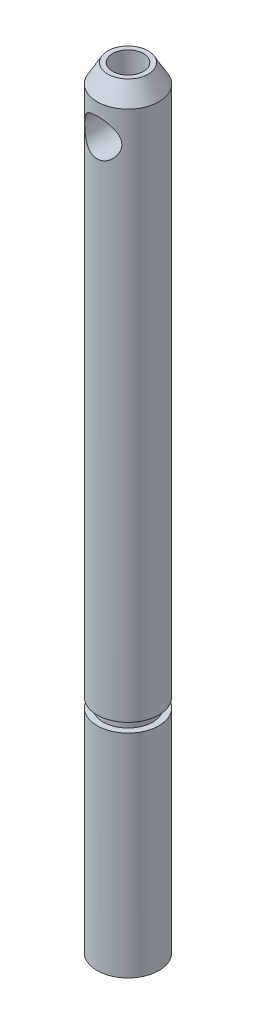
ISO-10303-21;
HEADER;
FILE_DESCRIPTION(('STEP AP214'),'2;1');
FILE_NAME('part.step','',(''),(''),'','','');
FILE_SCHEMA(('AUTOMOTIVE_DESIGN { 1 0 10303 214 1 1 1 1 }'));
ENDSEC;
DATA;
#1=APPLICATION_CONTEXT('core data for automotive mechanical design processes');
#2=APPLICATION_PROTOCOL_DEFINITION('international standard','automotive_design',2000,#1);
#3=PRODUCT_CONTEXT('',#1,'mechanical');
#4=PRODUCT('Part','Part','',(#3));
#5=PRODUCT_RELATED_PRODUCT_CATEGORY('part','',(#4));
#6=PRODUCT_DEFINITION_FORMATION('','',#4);
#7=PRODUCT_DEFINITION_CONTEXT('part definition',#1,'design');
#8=PRODUCT_DEFINITION('design','',#6,#7);
#9=PRODUCT_DEFINITION_SHAPE('','',#8);
#10=(LENGTH_UNIT() NAMED_UNIT(*) SI_UNIT(.MILLI.,.METRE.));
#11=(NAMED_UNIT(*) PLANE_ANGLE_UNIT() SI_UNIT($,.RADIAN.));
#12=(NAMED_UNIT(*) SI_UNIT($,.STERADIAN.) SOLID_ANGLE_UNIT());
#13=UNCERTAINTY_MEASURE_WITH_UNIT(LENGTH_MEASURE(1.E-05),#10,'distance_accuracy_value','');
#14=(GEOMETRIC_REPRESENTATION_CONTEXT(3) GLOBAL_UNCERTAINTY_ASSIGNED_CONTEXT((#13)) GLOBAL_UNIT_ASSIGNED_CONTEXT((#10,
#11,#12)) REPRESENTATION_CONTEXT('',''));
#15=CARTESIAN_POINT('',(0.,0.,0.));
#16=DIRECTION('',(0.,0.,1.));
#17=DIRECTION('',(1.,0.,0.));
#18=AXIS2_PLACEMENT_3D('',#15,#16,#17);
#19=CARTESIAN_POINT('',(-2.5,6.,-2.5));
#20=DIRECTION('',(0.,1.,0.));
#21=DIRECTION('',(0.,0.,1.));
#22=AXIS2_PLACEMENT_3D('',#19,#20,#21);
#23=PLANE('',#22);
#24=CARTESIAN_POINT('',(0.,6.,0.));
#25=DIRECTION('',(0.,-1.,0.));
#26=DIRECTION('',(0.,0.,-1.));
#27=AXIS2_PLACEMENT_3D('',#24,#25,#26);
#28=CIRCLE('',#27,2.5);
#29=CARTESIAN_POINT('',(-1.5,6.,-2.));
#30=VERTEX_POINT('',#29);
#31=CARTESIAN_POINT('',(-1.5,6.,2.));
#32=VERTEX_POINT('',#31);
#33=EDGE_CURVE('E20',#30,#32,#28,.F.);
#34=ORIENTED_EDGE('',*,*,#33,.F.);
#35=DIRECTION('',(0.,0.,-1.));
#36=VECTOR('',#35,1.);
#37=CARTESIAN_POINT('',(-1.5,6.,-2.5));
#38=LINE('',#37,#36);
#39=EDGE_CURVE('E43',#30,#32,#38,.F.);
#40=ORIENTED_EDGE('',*,*,#39,.T.);
#41=EDGE_LOOP('',(#34,#40));
#42=FACE_BOUND('',#41,.T.);
#43=ADVANCED_FACE('F17',(#42),#23,.F.);
#44=CARTESIAN_POINT('',(-1.5,0.,-2.5));
#45=DIRECTION('',(1.,0.,0.));
#46=DIRECTION('',(0.,0.,-1.));
#47=AXIS2_PLACEMENT_3D('',#44,#45,#46);
#48=PLANE('',#47);
#49=DIRECTION('',(0.,-1.,0.));
#50=VECTOR('',#49,1.);
#51=CARTESIAN_POINT('',(-1.5,62.34264779,-2.));
#52=LINE('',#51,#50);
#53=CARTESIAN_POINT('',(-1.5,0.,-2.));
#54=VERTEX_POINT('',#53);
#55=EDGE_CURVE('E51',#54,#30,#52,.F.);
#56=ORIENTED_EDGE('',*,*,#55,.F.);
#57=DIRECTION('',(0.,0.,1.));
#58=VECTOR('',#57,1.);
#59=CARTESIAN_POINT('',(-1.5,0.,0.));
#60=LINE('',#59,#58);
#61=CARTESIAN_POINT('',(-1.5,0.,2.));
#62=VERTEX_POINT('',#61);
#63=EDGE_CURVE('E54',#54,#62,#60,.T.);
#64=ORIENTED_EDGE('',*,*,#63,.T.);
#65=DIRECTION('',(0.,-1.,0.));
#66=VECTOR('',#65,1.);
#67=CARTESIAN_POINT('',(-1.5,62.34264779,2.));
#68=LINE('',#67,#66);
#69=EDGE_CURVE('E52',#32,#62,#68,.T.);
#70=ORIENTED_EDGE('',*,*,#69,.F.);
#71=ORIENTED_EDGE('',*,*,#39,.F.);
#72=EDGE_LOOP('',(#56,#64,#70,#71));
#73=FACE_BOUND('',#72,.T.);
#74=ADVANCED_FACE('F57',(#73),#48,.F.);
#75=CARTESIAN_POINT('',(0.,0.,0.));
#76=DIRECTION('',(0.,1.,0.));
#77=DIRECTION('',(0.,0.,1.));
#78=AXIS2_PLACEMENT_3D('',#75,#76,#77);
#79=PLANE('',#78);
#80=ORIENTED_EDGE('',*,*,#63,.F.);
#81=CARTESIAN_POINT('',(0.,0.,0.));
#82=DIRECTION('',(0.,-1.,0.));
#83=DIRECTION('',(0.,0.,-1.));
#84=AXIS2_PLACEMENT_3D('',#81,#82,#83);
#85=CIRCLE('',#84,2.5);
#86=EDGE_CURVE('E34',#62,#54,#85,.F.);
#87=ORIENTED_EDGE('',*,*,#86,.F.);
#88=EDGE_LOOP('',(#80,#87));
#89=FACE_BOUND('',#88,.T.);
#90=ADVANCED_FACE('F55',(#89),#79,.F.);
#91=CARTESIAN_POINT('',(0.,62.34264779,0.));
#92=DIRECTION('',(0.,-1.,0.));
#93=DIRECTION('',(0.,0.,-1.));
#94=AXIS2_PLACEMENT_3D('',#91,#92,#93);
#95=CYLINDRICAL_SURFACE('',#94,2.5);
#96=ORIENTED_EDGE('',*,*,#69,.T.);
#97=ORIENTED_EDGE('',*,*,#86,.T.);
#98=ORIENTED_EDGE('',*,*,#55,.T.);
#99=ORIENTED_EDGE('',*,*,#33,.T.);
#100=EDGE_LOOP('',(#96,#97,#98,#99));
#101=FACE_BOUND('',#100,.T.);
#102=CARTESIAN_POINT('',(0.,17.15,0.));
#103=DIRECTION('',(0.,-1.,0.));
#104=DIRECTION('',(0.,0.,-1.));
#105=AXIS2_PLACEMENT_3D('',#102,#103,#104);
#106=CIRCLE('',#105,2.5);
#107=CARTESIAN_POINT('',(0.,17.15,-2.5));
#108=VERTEX_POINT('',#107);
#109=EDGE_CURVE('E53',#108,#108,#106,.F.);
#110=ORIENTED_EDGE('',*,*,#109,.F.);
#111=EDGE_LOOP('',(#110));
#112=FACE_BOUND('',#111,.T.);
#113=ADVANCED_FACE('F48',(#101,#112),#95,.T.);
#114=CARTESIAN_POINT('',(0.,17.15,0.));
#115=DIRECTION('',(0.,1.,0.));
#116=DIRECTION('',(0.,0.,1.));
#117=AXIS2_PLACEMENT_3D('',#114,#115,#116);
#118=PLANE('',#117);
#119=ORIENTED_EDGE('',*,*,#109,.T.);
#120=EDGE_LOOP('',(#119));
#121=FACE_BOUND('',#120,.T.);
#122=CARTESIAN_POINT('',(0.,17.15,0.));
#123=DIRECTION('',(0.,-1.,0.));
#124=DIRECTION('',(0.,0.,-1.));
#125=AXIS2_PLACEMENT_3D('',#122,#123,#124);
#126=CIRCLE('',#125,2.);
#127=CARTESIAN_POINT('',(0.,17.15,-2.));
#128=VERTEX_POINT('',#127);
#129=EDGE_CURVE('E133',#128,#128,#126,.F.);
#130=ORIENTED_EDGE('',*,*,#129,.F.);
#131=EDGE_LOOP('',(#130));
#132=FACE_BOUND('',#131,.T.);
#133=ADVANCED_FACE('F103',(#121,#132),#118,.T.);
#134=CARTESIAN_POINT('',(0.,62.34264779,0.));
#135=DIRECTION('',(0.,1.,0.));
#136=DIRECTION('',(0.,0.,1.));
#137=AXIS2_PLACEMENT_3D('',#134,#135,#136);
#138=PLANE('',#137);
#139=CARTESIAN_POINT('',(0.,62.3426477899329,0.));
#140=DIRECTION('',(0.,-1.,0.));
#141=DIRECTION('',(0.,0.,-1.));
#142=AXIS2_PLACEMENT_3D('',#139,#140,#141);
#143=CIRCLE('',#142,1.63397459617341);
#144=CARTESIAN_POINT('',(0.,62.3426477899329,-1.63397459617341));
#145=VERTEX_POINT('',#144);
#146=EDGE_CURVE('E129',#145,#145,#143,.T.);
#147=ORIENTED_EDGE('',*,*,#146,.F.);
#148=EDGE_LOOP('',(#147));
#149=FACE_BOUND('',#148,.T.);
#150=CARTESIAN_POINT('',(0.,62.34264779,0.));
#151=DIRECTION('',(0.,1.,0.));
#152=DIRECTION('',(0.,0.,1.));
#153=AXIS2_PLACEMENT_3D('',#150,#151,#152);
#154=CIRCLE('',#153,1.24999999999999);
#155=CARTESIAN_POINT('',(0.,62.34264779,1.24999999999999));
#156=VERTEX_POINT('',#155);
#157=EDGE_CURVE('E130',#156,#156,#154,.F.);
#158=ORIENTED_EDGE('',*,*,#157,.T.);
#159=EDGE_LOOP('',(#158));
#160=FACE_BOUND('',#159,.T.);
#161=ADVANCED_FACE('F99',(#149,#160),#138,.T.);
#162=CARTESIAN_POINT('',(0.,17.9,0.));
#163=DIRECTION('',(0.,-1.,0.));
#164=DIRECTION('',(0.,0.,-1.));
#165=AXIS2_PLACEMENT_3D('',#162,#163,#164);
#166=CYLINDRICAL_SURFACE('',#165,2.);
#167=CARTESIAN_POINT('',(0.,17.9,0.));
#168=DIRECTION('',(0.,-1.,0.));
#169=DIRECTION('',(0.,0.,-1.));
#170=AXIS2_PLACEMENT_3D('',#167,#168,#169);
#171=CIRCLE('',#170,2.);
#172=CARTESIAN_POINT('',(0.,17.9,-2.));
#173=VERTEX_POINT('',#172);
#174=EDGE_CURVE('E87',#173,#173,#171,.T.);
#175=ORIENTED_EDGE('',*,*,#174,.T.);
#176=EDGE_LOOP('',(#175));
#177=FACE_BOUND('',#176,.T.);
#178=ORIENTED_EDGE('',*,*,#129,.T.);
#179=EDGE_LOOP('',(#178));
#180=FACE_BOUND('',#179,.T.);
#181=ADVANCED_FACE('F95',(#177,#180),#166,.T.);
#182=CARTESIAN_POINT('',(0.,62.34264779,0.));
#183=DIRECTION('',(0.,1.,0.));
#184=DIRECTION('',(0.,0.,1.));
#185=AXIS2_PLACEMENT_3D('',#182,#183,#184);
#186=CYLINDRICAL_SURFACE('',#185,1.24999999999999);
#187=ORIENTED_EDGE('',*,*,#157,.F.);
#188=EDGE_LOOP('',(#187));
#189=FACE_BOUND('',#188,.T.);
#190=CARTESIAN_POINT('',(0.,59.84264779,1.24999999999999));
#191=CARTESIAN_POINT('',(-0.0593862108893855,59.8426462254231,1.24999840223836));
#192=CARTESIAN_POINT('',(-0.118783629228726,59.8390909261592,1.24573846293185));
#193=CARTESIAN_POINT('',(-0.235596832688722,59.825200205701,1.22901697889288));
#194=CARTESIAN_POINT('',(-0.293011355967574,59.8148605479273,1.21655030934694));
#195=CARTESIAN_POINT('',(-0.4039148520295,59.7883613388128,1.18434409367316));
#196=CARTESIAN_POINT('',(-0.457424881903688,59.7722362926995,1.16464765163541));
#197=CARTESIAN_POINT('',(-0.559919566606722,59.7352942664348,1.11899204778939));
#198=CARTESIAN_POINT('',(-0.608902608913669,59.7144756234275,1.09303066619723));
#199=CARTESIAN_POINT('',(-0.718951238642796,59.6610174010017,1.02527233436066));
#200=CARTESIAN_POINT('',(-0.77784639940029,59.6268446313228,0.981161421871724));
#201=CARTESIAN_POINT('',(-0.886006686488863,59.5547668282188,0.884741313262738));
#202=CARTESIAN_POINT('',(-0.935244207529233,59.5168515485879,0.832409364542025));
#203=CARTESIAN_POINT('',(-1.02476983798438,59.4396432509587,0.719475641159833));
#204=CARTESIAN_POINT('',(-1.06487544430448,59.4003377215115,0.658738733919066));
#205=CARTESIAN_POINT('',(-1.13460949608151,59.3251211355924,0.529649265340283));
#206=CARTESIAN_POINT('',(-1.16426871520539,59.2892003410764,0.461319866247311));
#207=CARTESIAN_POINT('',(-1.20096809439559,59.241614492326,0.349152320443061));
#208=CARTESIAN_POINT('',(-1.21216917782273,59.2263312426768,0.308234148450566));
#209=CARTESIAN_POINT('',(-1.23050643067161,59.2006117991523,0.224058905453696));
#210=CARTESIAN_POINT('',(-1.23765246664524,59.1901638517805,0.180807794373419));
#211=CARTESIAN_POINT('',(-1.24740539221829,59.175752933635,0.092116217355069));
#212=CARTESIAN_POINT('',(-1.24995600516591,59.1718703993564,0.0466555184271497));
#213=CARTESIAN_POINT('',(-1.25004286689023,59.1717392762581,-0.0442807059069726));
#214=CARTESIAN_POINT('',(-1.24757904453308,59.1754907957337,-0.0897562315143542));
#215=CARTESIAN_POINT('',(-1.23752619395373,59.1903556893603,-0.182763617342337));
#216=CARTESIAN_POINT('',(-1.22952742988471,59.2020561351512,-0.230151334824196));
#217=CARTESIAN_POINT('',(-1.20871315183512,59.2310903716655,-0.322101270368631));
#218=CARTESIAN_POINT('',(-1.19588166745774,59.2484428142111,-0.366653541301658));
#219=CARTESIAN_POINT('',(-1.15722563573576,59.2977869252654,-0.478104398962175));
#220=CARTESIAN_POINT('',(-1.12819926112772,59.3323823324722,-0.542714881249848));
#221=CARTESIAN_POINT('',(-1.0607172141723,59.4044114208193,-0.665028745762589));
#222=CARTESIAN_POINT('',(-1.0222446909771,59.4418500906604,-0.722719507187034));
#223=CARTESIAN_POINT('',(-0.933840379141559,59.5180312554999,-0.834118223949501));
#224=CARTESIAN_POINT('',(-0.883415624625791,59.5567399273556,-0.887461584333355));
#225=CARTESIAN_POINT('',(-0.772423842793293,59.6301942554712,-0.985556233166051));
#226=CARTESIAN_POINT('',(-0.711878443813805,59.6649481026967,-1.03032541634234));
#227=CARTESIAN_POINT('',(-0.597043972785364,59.7197980212542,-1.09971479649105));
#228=CARTESIAN_POINT('',(-0.544838910103937,59.741400897607,-1.1265855335296));
#229=CARTESIAN_POINT('',(-0.43550123495752,59.779195941306,-1.17318254741894));
#230=CARTESIAN_POINT('',(-0.37837443534328,59.7953943842958,-1.19291711306153));
#231=CARTESIAN_POINT('',(-0.268099249929752,59.8194289044178,-1.22206407173247));
#232=CARTESIAN_POINT('',(-0.215395620136184,59.8280769981845,-1.23248316066811));
#233=CARTESIAN_POINT('',(-0.108464202701556,59.839686488855,-1.24645104909721));
#234=CARTESIAN_POINT('',(-0.0542367754002226,59.8426492189109,-1.25000145921818));
#235=CARTESIAN_POINT('',(0.0593862108893855,59.8426462254231,-1.24999840223836));
#236=CARTESIAN_POINT('',(0.118783629228727,59.8390909261592,-1.24573846293185));
#237=CARTESIAN_POINT('',(0.235596832688722,59.825200205701,-1.22901697889288));
#238=CARTESIAN_POINT('',(0.293011355967574,59.8148605479273,-1.21655030934694));
#239=CARTESIAN_POINT('',(0.403914852029501,59.7883613388128,-1.18434409367316));
#240=CARTESIAN_POINT('',(0.457424881903689,59.7722362926995,-1.16464765163541));
#241=CARTESIAN_POINT('',(0.559919566606722,59.7352942664348,-1.11899204778939));
#242=CARTESIAN_POINT('',(0.60890260891367,59.7144756234275,-1.09303066619723));
#243=CARTESIAN_POINT('',(0.718951238642797,59.6610174010017,-1.02527233436066));
#244=CARTESIAN_POINT('',(0.777846399400291,59.6268446313228,-0.981161421871723));
#245=CARTESIAN_POINT('',(0.886006686488864,59.5547668282188,-0.884741313262737));
#246=CARTESIAN_POINT('',(0.935244207529234,59.5168515485879,-0.832409364542024));
#247=CARTESIAN_POINT('',(1.02476983798438,59.4396432509587,-0.719475641159832));
#248=CARTESIAN_POINT('',(1.06487544430448,59.4003377215115,-0.658738733919065));
#249=CARTESIAN_POINT('',(1.13460949608151,59.3251211355924,-0.529649265340281));
#250=CARTESIAN_POINT('',(1.16426871520539,59.2892003410764,-0.461319866247308));
#251=CARTESIAN_POINT('',(1.20096809439559,59.241614492326,-0.349152320443057));
#252=CARTESIAN_POINT('',(1.21216917782273,59.2263312426768,-0.308234148450561));
#253=CARTESIAN_POINT('',(1.23050643067161,59.2006117991522,-0.224058905453691));
#254=CARTESIAN_POINT('',(1.23765246664524,59.1901638517805,-0.180807794373413));
#255=CARTESIAN_POINT('',(1.24740539221829,59.175752933635,-0.0921162173550637));
#256=CARTESIAN_POINT('',(1.24995600516591,59.1718703993564,-0.0466555184271445));
#257=CARTESIAN_POINT('',(1.25004286689023,59.1717392762581,0.044280705906978));
#258=CARTESIAN_POINT('',(1.24757904453308,59.1754907957337,0.0897562315143598));
#259=CARTESIAN_POINT('',(1.23752619395373,59.1903556893603,0.182763617342343));
#260=CARTESIAN_POINT('',(1.22952742988471,59.2020561351512,0.230151334824203));
#261=CARTESIAN_POINT('',(1.20871315183512,59.2310903716655,0.322101270368639));
#262=CARTESIAN_POINT('',(1.19588166745774,59.2484428142111,0.366653541301667));
#263=CARTESIAN_POINT('',(1.15722563573575,59.2977869252654,0.478104398962184));
#264=CARTESIAN_POINT('',(1.12819926112772,59.3323823324722,0.542714881249858));
#265=CARTESIAN_POINT('',(1.06071721417229,59.4044114208193,0.665028745762601));
#266=CARTESIAN_POINT('',(1.02224469097709,59.4418500906604,0.722719507187049));
#267=CARTESIAN_POINT('',(0.933840379141546,59.5180312554999,0.834118223949516));
#268=CARTESIAN_POINT('',(0.883415624625778,59.5567399273557,0.887461584333368));
#269=CARTESIAN_POINT('',(0.772423842793279,59.6301942554712,0.985556233166062));
#270=CARTESIAN_POINT('',(0.711878443813788,59.6649481026967,1.03032541634236));
#271=CARTESIAN_POINT('',(0.597043972785347,59.7197980212542,1.09971479649106));
#272=CARTESIAN_POINT('',(0.544838910103921,59.741400897607,1.12658553352961));
#273=CARTESIAN_POINT('',(0.435501234957505,59.779195941306,1.17318254741894));
#274=CARTESIAN_POINT('',(0.378374435343263,59.7953943842958,1.19291711306154));
#275=CARTESIAN_POINT('',(0.268099249929737,59.8194289044178,1.22206407173247));
#276=CARTESIAN_POINT('',(0.215395620136172,59.8280769981845,1.23248316066811));
#277=CARTESIAN_POINT('',(0.10846420270155,59.839686488855,1.24645104909721));
#278=CARTESIAN_POINT('',(0.0542367754002195,59.8426492189109,1.25000145921818));
#279=CARTESIAN_POINT('',(0.,59.84264779,1.24999999999999));
#280=B_SPLINE_CURVE_WITH_KNOTS('',3,(#190,#191,#192,#193,#194,#195,#196,#197,#198,#199,#200,
#201,#202,#203,#204,#205,#206,#207,#208,#209,#210,#211,#212,#213,#214,#215,#216,#217,#218,#219,
#220,#221,#222,#223,#224,#225,#226,#227,#228,#229,#230,#231,#232,#233,#234,#235,#236,#237,#238,
#239,#240,#241,#242,#243,#244,#245,#246,#247,#248,#249,#250,#251,#252,#253,#254,#255,#256,#257,
#258,#259,#260,#261,#262,#263,#264,#265,#266,#267,#268,#269,#270,#271,#272,#273,#274,#275,#276,
#277,#278,#279),.UNSPECIFIED.,.T.,.F.,(4,2,2,2,2,2,2,2,2,2,2,2,2,2,2,2,2,2,2,2,2,2,2,2,2,2,2,2,
2,2,2,2,2,2,2,2,2,2,2,2,2,2,2,2,4),(0.,0.177930937889002,0.355973092906779,0.532970554628085,
0.710030822140077,0.952125903940765,1.19490321356839,1.44217387415895,1.68870989294429,
1.82361318456846,1.95818681265893,2.09439754075969,2.23061020113417,2.37816655612912,
2.52621487216841,2.76143399504807,2.99707581002108,3.24500621660523,3.49241340274582,
3.6793903649474,3.8661494470989,4.02868994068313,4.19119231573804,4.36912325362705,
4.54716540864482,4.72416287036613,4.90122313787812,5.14331821967881,5.38609552930643,
5.633366189897,5.87990220868233,6.01480550030651,6.14937912839697,6.28558985649774,
6.42180251687222,6.56935887186717,6.71740718790647,6.95262631078612,7.18826812575915,
7.4361985323433,7.68360571848388,7.87058268068546,8.05734176283696,8.21988225642119,
8.38238463147608),.UNSPECIFIED.);
#281=CARTESIAN_POINT('',(0.,59.84264779,1.24999999999999));
#282=VERTEX_POINT('',#281);
#283=EDGE_CURVE('E81',#282,#282,#280,.T.);
#284=ORIENTED_EDGE('',*,*,#283,.T.);
#285=EDGE_LOOP('',(#284));
#286=FACE_BOUND('',#285,.T.);
#287=ADVANCED_FACE('F89',(#189,#286),#186,.F.);
#288=CARTESIAN_POINT('',(0.,60.8426477901389,0.));
#289=DIRECTION('',(0.,-1.,0.));
#290=DIRECTION('',(0.,0.,-1.));
#291=AXIS2_PLACEMENT_3D('',#288,#289,#290);
#292=CONICAL_SURFACE('',#291,2.4999999998272,0.523598775592442);
#293=CARTESIAN_POINT('',(0.,60.84264779,0.));
#294=DIRECTION('',(0.,-1.,0.));
#295=DIRECTION('',(0.,0.,-1.));
#296=AXIS2_PLACEMENT_3D('',#293,#294,#295);
#297=CIRCLE('',#296,2.5);
#298=CARTESIAN_POINT('',(0.,60.84264779,-2.5));
#299=VERTEX_POINT('',#298);
#300=EDGE_CURVE('E80',#299,#299,#297,.T.);
#301=ORIENTED_EDGE('',*,*,#300,.F.);
#302=EDGE_LOOP('',(#301));
#303=FACE_BOUND('',#302,.T.);
#304=ORIENTED_EDGE('',*,*,#146,.T.);
#305=EDGE_LOOP('',(#304));
#306=FACE_BOUND('',#305,.T.);
#307=ADVANCED_FACE('F94',(#303,#306),#292,.T.);
#308=CARTESIAN_POINT('',(0.,17.9,0.));
#309=DIRECTION('',(0.,1.,0.));
#310=DIRECTION('',(0.,0.,1.));
#311=AXIS2_PLACEMENT_3D('',#308,#309,#310);
#312=PLANE('',#311);
#313=CARTESIAN_POINT('',(0.,17.9,0.));
#314=DIRECTION('',(0.,-1.,0.));
#315=DIRECTION('',(0.,0.,-1.));
#316=AXIS2_PLACEMENT_3D('',#313,#314,#315);
#317=CIRCLE('',#316,2.5);
#318=CARTESIAN_POINT('',(0.,17.9,-2.5));
#319=VERTEX_POINT('',#318);
#320=EDGE_CURVE('E26',#319,#319,#317,.F.);
#321=ORIENTED_EDGE('',*,*,#320,.F.);
#322=EDGE_LOOP('',(#321));
#323=FACE_BOUND('',#322,.T.);
#324=ORIENTED_EDGE('',*,*,#174,.F.);
#325=EDGE_LOOP('',(#324));
#326=FACE_BOUND('',#325,.T.);
#327=ADVANCED_FACE('F126',(#323,#326),#312,.F.);
#328=CARTESIAN_POINT('',(0.,58.34264779,-2.5));
#329=DIRECTION('',(0.,0.,1.));
#330=DIRECTION('',(1.,0.,0.));
#331=AXIS2_PLACEMENT_3D('',#328,#329,#330);
#332=CYLINDRICAL_SURFACE('',#331,1.5);
#333=CARTESIAN_POINT('',(0.,56.84264779,-2.5));
#334=CARTESIAN_POINT('',(0.0768783200983839,56.8426477328012,-2.49999997420093));
#335=CARTESIAN_POINT('',(0.153758343000942,56.8485876122371,-2.49642261673451));
#336=CARTESIAN_POINT('',(0.305109101293403,56.8720088812641,-2.48247692790154));
#337=CARTESIAN_POINT('',(0.379578791095915,56.8894952110675,-2.47210568975079));
#338=CARTESIAN_POINT('',(0.523740789759279,56.9350288314118,-2.44561876079597));
#339=CARTESIAN_POINT('',(0.59345152679371,56.9630322896969,-2.42952692640382));
#340=CARTESIAN_POINT('',(0.727000775809285,57.02849163723,-2.39296265049464));
#341=CARTESIAN_POINT('',(0.790838153744173,57.0659493467292,-2.37248936552121));
#342=CARTESIAN_POINT('',(0.916303714976432,57.1524254124022,-2.32705216798543));
#343=CARTESIAN_POINT('',(0.977391700470288,57.2021077762151,-2.30186481024781));
#344=CARTESIAN_POINT('',(1.09088904280231,57.3101220466456,-2.25030113470619));
#345=CARTESIAN_POINT('',(1.14328818082776,57.3684639870261,-2.22392346270707));
#346=CARTESIAN_POINT('',(1.24444292051991,57.500562588928,-2.16911454973351));
#347=CARTESIAN_POINT('',(1.29196528566181,57.5753321000105,-2.14082773401535));
#348=CARTESIAN_POINT('',(1.37360479759806,57.7334693110253,-2.08938929345138));
#349=CARTESIAN_POINT('',(1.40774015317978,57.8168251356417,-2.06623071207603));
#350=CARTESIAN_POINT('',(1.45575449105208,57.9736526208773,-2.03260248093514));
#351=CARTESIAN_POINT('',(1.47225581658033,58.0459752998861,-2.02055480288446));
#352=CARTESIAN_POINT('',(1.49437070785254,58.1930836741687,-2.00425911034262));
#353=CARTESIAN_POINT('',(1.49999988708877,58.2678656802868,-1.99999991128341));
#354=CARTESIAN_POINT('',(1.50000011393985,58.4181111603585,-2.00000008952479));
#355=CARTESIAN_POINT('',(1.49426813346275,58.4935746362081,-2.00433742403308));
#356=CARTESIAN_POINT('',(1.47175260051501,58.6419664703544,-2.02092293793292));
#357=CARTESIAN_POINT('',(1.45495626731345,58.714891794075,-2.03318026560784));
#358=CARTESIAN_POINT('',(1.41143460029607,58.8557305938171,-2.06362380170314));
#359=CARTESIAN_POINT('',(1.38478151658577,58.9236763320627,-2.08176675244534));
#360=CARTESIAN_POINT('',(1.32252919367599,59.0540853873395,-2.12185891081177));
#361=CARTESIAN_POINT('',(1.28692727555726,59.116547055093,-2.14380925760552));
#362=CARTESIAN_POINT('',(1.20271412504554,59.2425949996288,-2.19228531514782));
#363=CARTESIAN_POINT('',(1.15304462671222,59.3053854301068,-2.21904232399507));
#364=CARTESIAN_POINT('',(1.04427083617049,59.4224097856356,-2.27226091423522));
#365=CARTESIAN_POINT('',(0.985158987763859,59.47663678814,-2.29872224070947));
#366=CARTESIAN_POINT('',(0.851428132008542,59.5807933687557,-2.35176172385154));
#367=CARTESIAN_POINT('',(0.775823259708379,59.6296229578549,-2.37804267675821));
#368=CARTESIAN_POINT('',(0.61561295434314,59.7134734682293,-2.4244468177991));
#369=CARTESIAN_POINT('',(0.531019856693933,59.7485130118503,-2.44457830200988));
#370=CARTESIAN_POINT('',(0.37223077877728,59.7976294954917,-2.47318793265859));
#371=CARTESIAN_POINT('',(0.299144573757812,59.8144353163816,-2.48315917613949));
#372=CARTESIAN_POINT('',(0.150705182896667,59.8369410460144,-2.49656322689937));
#373=CARTESIAN_POINT('',(0.07535340940963,59.8426477339357,-2.50000002528734));
#374=CARTESIAN_POINT('',(-0.0768783200983843,59.8426478471988,-2.49999997420093));
#375=CARTESIAN_POINT('',(-0.153758343000942,59.8367079677629,-2.49642261673451));
#376=CARTESIAN_POINT('',(-0.305109101293403,59.8132866987359,-2.48247692790154));
#377=CARTESIAN_POINT('',(-0.379578791095916,59.7958003689325,-2.47210568975079));
#378=CARTESIAN_POINT('',(-0.52374078975928,59.7502667485882,-2.44561876079597));
#379=CARTESIAN_POINT('',(-0.593451526793709,59.722263290303,-2.42952692640382));
#380=CARTESIAN_POINT('',(-0.727000775809284,59.65680394277,-2.39296265049464));
#381=CARTESIAN_POINT('',(-0.790838153744173,59.6193462332708,-2.37248936552121));
#382=CARTESIAN_POINT('',(-0.916303714976434,59.5328701675977,-2.32705216798543));
#383=CARTESIAN_POINT('',(-0.977391700470292,59.4831878037849,-2.3018648102478));
#384=CARTESIAN_POINT('',(-1.09088904280231,59.3751735333544,-2.25030113470619));
#385=CARTESIAN_POINT('',(-1.14328818082776,59.3168315929739,-2.22392346270707));
#386=CARTESIAN_POINT('',(-1.24444292051991,59.184732991072,-2.16911454973351));
#387=CARTESIAN_POINT('',(-1.29196528566181,59.1099634799894,-2.14082773401535));
#388=CARTESIAN_POINT('',(-1.37360479759806,58.9518262689747,-2.08938929345138));
#389=CARTESIAN_POINT('',(-1.40774015317979,58.8684704443583,-2.06623071207603));
#390=CARTESIAN_POINT('',(-1.45575449105208,58.7116429591227,-2.03260248093514));
#391=CARTESIAN_POINT('',(-1.47225581658033,58.6393202801139,-2.02055480288446));
#392=CARTESIAN_POINT('',(-1.49437070785254,58.4922119058312,-2.00425911034262));
#393=CARTESIAN_POINT('',(-1.49999988708877,58.4174298997132,-1.99999991128341));
#394=CARTESIAN_POINT('',(-1.50000011393985,58.2671844196415,-2.00000008952479));
#395=CARTESIAN_POINT('',(-1.49426813346275,58.1917209437919,-2.00433742403308));
#396=CARTESIAN_POINT('',(-1.47175260051501,58.0433291096456,-2.02092293793292));
#397=CARTESIAN_POINT('',(-1.45495626731345,57.970403785925,-2.03318026560784));
#398=CARTESIAN_POINT('',(-1.41143460029606,57.8295649861829,-2.06362380170314));
#399=CARTESIAN_POINT('',(-1.38478151658576,57.7616192479372,-2.08176675244534));
#400=CARTESIAN_POINT('',(-1.32252919367598,57.6312101926605,-2.12185891081178));
#401=CARTESIAN_POINT('',(-1.28692727555726,57.568748524907,-2.14380925760553));
#402=CARTESIAN_POINT('',(-1.20271412504554,57.4427005803711,-2.19228531514782));
#403=CARTESIAN_POINT('',(-1.15304462671222,57.3799101498932,-2.21904232399507));
#404=CARTESIAN_POINT('',(-1.04427083617049,57.2628857943643,-2.27226091423522));
#405=CARTESIAN_POINT('',(-0.985158987763859,57.20865879186,-2.29872224070947));
#406=CARTESIAN_POINT('',(-0.851428132008542,57.1045022112443,-2.35176172385154));
#407=CARTESIAN_POINT('',(-0.775823259708378,57.055672622145,-2.37804267675821));
#408=CARTESIAN_POINT('',(-0.615612954343139,56.9718221117707,-2.4244468177991));
#409=CARTESIAN_POINT('',(-0.531019856693933,56.9367825681497,-2.44457830200988));
#410=CARTESIAN_POINT('',(-0.372230778777279,56.8876660845083,-2.47318793265859));
#411=CARTESIAN_POINT('',(-0.299144573757812,56.8708602636184,-2.48315917613949));
#412=CARTESIAN_POINT('',(-0.150705182896667,56.8483545339856,-2.49656322689937));
#413=CARTESIAN_POINT('',(-0.0753534094096301,56.8426478460642,-2.50000002528734));
#414=CARTESIAN_POINT('',(0.,56.84264779,-2.5));
#415=B_SPLINE_CURVE_WITH_KNOTS('',3,(#333,#334,#335,#336,#337,#338,#339,#340,#341,#342,#343,
#344,#345,#346,#347,#348,#349,#350,#351,#352,#353,#354,#355,#356,#357,#358,#359,#360,#361,#362,
#363,#364,#365,#366,#367,#368,#369,#370,#371,#372,#373,#374,#375,#376,#377,#378,#379,#380,#381,
#382,#383,#384,#385,#386,#387,#388,#389,#390,#391,#392,#393,#394,#395,#396,#397,#398,#399,#400,
#401,#402,#403,#404,#405,#406,#407,#408,#409,#410,#411,#412,#413,#414),.UNSPECIFIED.,.T.,.F.,(4,
2,2,2,2,2,2,2,2,2,2,2,2,2,2,2,2,2,2,2,2,2,2,2,2,2,2,2,2,2,2,2,2,2,2,2,2,2,2,2,4),(0.,
0.230336986242877,0.460772587346644,0.690258271179262,0.919788172231055,1.16683110539655,
1.41416255213103,1.69180093541071,1.96906035883591,2.19341436821997,2.4174459424766,
2.64351843127051,2.86985252147267,3.09455944122894,3.319333709434,3.57158402978561,
3.8240372330379,4.10380837903962,4.38320040950001,4.60910659748833,4.83487476209349,
5.06521174833637,5.29564734944013,5.52513303327275,5.75466293432454,6.00170586749004,
6.24903731422452,6.52667569750421,6.8039351209294,7.02828913031346,7.25232070457008,
7.47839319336398,7.70472728356616,7.92943420332244,8.15420847152748,8.40645879187909,
8.65891199513139,8.9386831411331,9.21807517159349,9.44398135958181,9.66974952418697),.UNSPECIFIED.);
#416=CARTESIAN_POINT('',(0.,56.84264779,-2.5));
#417=VERTEX_POINT('',#416);
#418=EDGE_CURVE('E11',#417,#417,#415,.T.);
#419=ORIENTED_EDGE('',*,*,#418,.F.);
#420=EDGE_LOOP('',(#419));
#421=FACE_BOUND('',#420,.T.);
#422=ORIENTED_EDGE('',*,*,#283,.F.);
#423=EDGE_LOOP('',(#422));
#424=FACE_BOUND('',#423,.T.);
#425=CARTESIAN_POINT('',(0.,59.84264779,2.5));
#426=CARTESIAN_POINT('',(0.0768783200983842,59.8426478471988,2.49999997420093));
#427=CARTESIAN_POINT('',(0.153758343000942,59.8367079677629,2.49642261673451));
#428=CARTESIAN_POINT('',(0.305109101293403,59.8132866987359,2.48247692790154));
#429=CARTESIAN_POINT('',(0.379578791095915,59.7958003689325,2.47210568975079));
#430=CARTESIAN_POINT('',(0.52374078975928,59.7502667485882,2.44561876079597));
#431=CARTESIAN_POINT('',(0.59345152679371,59.722263290303,2.42952692640382));
#432=CARTESIAN_POINT('',(0.727000775809285,59.65680394277,2.39296265049464));
#433=CARTESIAN_POINT('',(0.790838153744174,59.6193462332708,2.37248936552121));
#434=CARTESIAN_POINT('',(0.916303714976433,59.5328701675977,2.32705216798543));
#435=CARTESIAN_POINT('',(0.977391700470289,59.4831878037849,2.30186481024781));
#436=CARTESIAN_POINT('',(1.09088904280231,59.3751735333544,2.25030113470619));
#437=CARTESIAN_POINT('',(1.14328818082776,59.3168315929739,2.22392346270707));
#438=CARTESIAN_POINT('',(1.24444292051991,59.184732991072,2.16911454973351));
#439=CARTESIAN_POINT('',(1.29196528566181,59.1099634799894,2.14082773401535));
#440=CARTESIAN_POINT('',(1.37360479759806,58.9518262689747,2.08938929345138));
#441=CARTESIAN_POINT('',(1.40774015317978,58.8684704443583,2.06623071207603));
#442=CARTESIAN_POINT('',(1.45575449105208,58.7116429591227,2.03260248093514));
#443=CARTESIAN_POINT('',(1.47225581658033,58.6393202801139,2.02055480288445));
#444=CARTESIAN_POINT('',(1.49437070785254,58.4922119058312,2.00425911034262));
#445=CARTESIAN_POINT('',(1.49999988708877,58.4174298997132,1.99999991128341));
#446=CARTESIAN_POINT('',(1.50000011393985,58.2671844196415,2.00000008952479));
#447=CARTESIAN_POINT('',(1.49426813346275,58.1917209437919,2.00433742403308));
#448=CARTESIAN_POINT('',(1.47175260051501,58.0433291096456,2.02092293793292));
#449=CARTESIAN_POINT('',(1.45495626731345,57.970403785925,2.03318026560784));
#450=CARTESIAN_POINT('',(1.41143460029606,57.8295649861829,2.06362380170314));
#451=CARTESIAN_POINT('',(1.38478151658577,57.7616192479372,2.08176675244534));
#452=CARTESIAN_POINT('',(1.32252919367599,57.6312101926605,2.12185891081177));
#453=CARTESIAN_POINT('',(1.28692727555727,57.568748524907,2.14380925760552));
#454=CARTESIAN_POINT('',(1.20271412504555,57.4427005803711,2.19228531514782));
#455=CARTESIAN_POINT('',(1.15304462671222,57.3799101498932,2.21904232399507));
#456=CARTESIAN_POINT('',(1.0442708361705,57.2628857943643,2.27226091423522));
#457=CARTESIAN_POINT('',(0.985158987763861,57.20865879186,2.29872224070947));
#458=CARTESIAN_POINT('',(0.851428132008542,57.1045022112443,2.35176172385154));
#459=CARTESIAN_POINT('',(0.775823259708379,57.055672622145,2.37804267675821));
#460=CARTESIAN_POINT('',(0.615612954343141,56.9718221117707,2.4244468177991));
#461=CARTESIAN_POINT('',(0.531019856693934,56.9367825681497,2.44457830200988));
#462=CARTESIAN_POINT('',(0.37223077877728,56.8876660845083,2.47318793265859));
#463=CARTESIAN_POINT('',(0.299144573757813,56.8708602636184,2.48315917613949));
#464=CARTESIAN_POINT('',(0.150705182896668,56.8483545339856,2.49656322689937));
#465=CARTESIAN_POINT('',(0.0753534094096305,56.8426478460642,2.50000002528734));
#466=CARTESIAN_POINT('',(-0.0768783200983837,56.8426477328012,2.49999997420093));
#467=CARTESIAN_POINT('',(-0.153758343000941,56.8485876122371,2.49642261673451));
#468=CARTESIAN_POINT('',(-0.305109101293402,56.8720088812641,2.48247692790154));
#469=CARTESIAN_POINT('',(-0.379578791095915,56.8894952110675,2.47210568975079));
#470=CARTESIAN_POINT('',(-0.523740789759279,56.9350288314118,2.44561876079597));
#471=CARTESIAN_POINT('',(-0.593451526793709,56.9630322896969,2.42952692640382));
#472=CARTESIAN_POINT('',(-0.727000775809285,57.02849163723,2.39296265049464));
#473=CARTESIAN_POINT('',(-0.790838153744173,57.0659493467292,2.37248936552121));
#474=CARTESIAN_POINT('',(-0.916303714976432,57.1524254124022,2.32705216798543));
#475=CARTESIAN_POINT('',(-0.977391700470287,57.2021077762151,2.30186481024781));
#476=CARTESIAN_POINT('',(-1.09088904280231,57.3101220466456,2.25030113470619));
#477=CARTESIAN_POINT('',(-1.14328818082776,57.3684639870261,2.22392346270707));
#478=CARTESIAN_POINT('',(-1.24444292051991,57.500562588928,2.16911454973351));
#479=CARTESIAN_POINT('',(-1.29196528566181,57.5753321000105,2.14082773401535));
#480=CARTESIAN_POINT('',(-1.37360479759806,57.7334693110253,2.08938929345138));
#481=CARTESIAN_POINT('',(-1.40774015317978,57.8168251356417,2.06623071207603));
#482=CARTESIAN_POINT('',(-1.45575449105208,57.9736526208773,2.03260248093514));
#483=CARTESIAN_POINT('',(-1.47225581658033,58.0459752998861,2.02055480288445));
#484=CARTESIAN_POINT('',(-1.49437070785254,58.1930836741688,2.00425911034262));
#485=CARTESIAN_POINT('',(-1.49999988708877,58.2678656802869,1.99999991128341));
#486=CARTESIAN_POINT('',(-1.50000011393985,58.4181111603585,2.00000008952479));
#487=CARTESIAN_POINT('',(-1.49426813346275,58.4935746362082,2.00433742403308));
#488=CARTESIAN_POINT('',(-1.471752600515,58.6419664703545,2.02092293793293));
#489=CARTESIAN_POINT('',(-1.45495626731343,58.7148917940751,2.03318026560785));
#490=CARTESIAN_POINT('',(-1.41143460029604,58.8557305938171,2.06362380170315));
#491=CARTESIAN_POINT('',(-1.38478151658574,58.9236763320628,2.08176675244535));
#492=CARTESIAN_POINT('',(-1.32252919367596,59.0540853873395,2.12185891081179));
#493=CARTESIAN_POINT('',(-1.28692727555723,59.116547055093,2.14380925760555));
#494=CARTESIAN_POINT('',(-1.2027141250455,59.2425949996289,2.19228531514785));
#495=CARTESIAN_POINT('',(-1.15304462671217,59.3053854301068,2.2190423239951));
#496=CARTESIAN_POINT('',(-1.04427083617044,59.4224097856357,2.27226091423524));
#497=CARTESIAN_POINT('',(-0.985158987763804,59.4766367881401,2.2987222407095));
#498=CARTESIAN_POINT('',(-0.851428132008482,59.5807933687557,2.35176172385156));
#499=CARTESIAN_POINT('',(-0.775823259708316,59.629622957855,2.37804267675823));
#500=CARTESIAN_POINT('',(-0.615612954343067,59.7134734682294,2.42444681779912));
#501=CARTESIAN_POINT('',(-0.531019856693854,59.7485130118504,2.44457830200989));
#502=CARTESIAN_POINT('',(-0.372230778777207,59.7976294954917,2.4731879326586));
#503=CARTESIAN_POINT('',(-0.299144573757753,59.8144353163816,2.4831591761395));
#504=CARTESIAN_POINT('',(-0.150705182896637,59.8369410460144,2.49656322689937));
#505=CARTESIAN_POINT('',(-0.075353409409615,59.8426477339357,2.50000002528734));
#506=CARTESIAN_POINT('',(0.,59.84264779,2.5));
#507=B_SPLINE_CURVE_WITH_KNOTS('',3,(#425,#426,#427,#428,#429,#430,#431,#432,#433,#434,#435,
#436,#437,#438,#439,#440,#441,#442,#443,#444,#445,#446,#447,#448,#449,#450,#451,#452,#453,#454,
#455,#456,#457,#458,#459,#460,#461,#462,#463,#464,#465,#466,#467,#468,#469,#470,#471,#472,#473,
#474,#475,#476,#477,#478,#479,#480,#481,#482,#483,#484,#485,#486,#487,#488,#489,#490,#491,#492,
#493,#494,#495,#496,#497,#498,#499,#500,#501,#502,#503,#504,#505,#506),.UNSPECIFIED.,.T.,.F.,(4,
2,2,2,2,2,2,2,2,2,2,2,2,2,2,2,2,2,2,2,2,2,2,2,2,2,2,2,2,2,2,2,2,2,2,2,2,2,2,2,4),(0.,
0.230336986242877,0.460772587346644,0.690258271179262,0.919788172231055,1.16683110539655,
1.41416255213103,1.69180093541071,1.96906035883591,2.19341436821999,2.4174459424766,
2.6435184312705,2.86985252147267,3.09455944122895,3.31933370943399,3.5715840297856,
3.8240372330379,4.10380837903962,4.38320040950001,4.60910659748833,4.83487476209349,
5.06521174833636,5.29564734944013,5.52513303327275,5.75466293432454,6.00170586749003,
6.24903731422451,6.5266756975042,6.80393512092939,7.02828913031349,7.25232070457014,
7.47839319336404,7.70472728356622,7.92943420332249,8.15420847152755,8.40645879187917,
8.65891199513146,8.93868314113318,9.21807517159358,9.44398135958186,9.66974952418697),.UNSPECIFIED.);
#508=CARTESIAN_POINT('',(0.,59.84264779,2.5));
#509=VERTEX_POINT('',#508);
#510=EDGE_CURVE('E75',#509,#509,#507,.T.);
#511=ORIENTED_EDGE('',*,*,#510,.F.);
#512=EDGE_LOOP('',(#511));
#513=FACE_BOUND('',#512,.T.);
#514=ADVANCED_FACE('F67',(#421,#424,#513),#332,.F.);
#515=CARTESIAN_POINT('',(0.,62.34264779,0.));
#516=DIRECTION('',(0.,-1.,0.));
#517=DIRECTION('',(0.,0.,-1.));
#518=AXIS2_PLACEMENT_3D('',#515,#516,#517);
#519=CYLINDRICAL_SURFACE('',#518,2.5);
#520=ORIENTED_EDGE('',*,*,#418,.T.);
#521=EDGE_LOOP('',(#520));
#522=FACE_BOUND('',#521,.T.);
#523=ORIENTED_EDGE('',*,*,#510,.T.);
#524=EDGE_LOOP('',(#523));
#525=FACE_BOUND('',#524,.T.);
#526=ORIENTED_EDGE('',*,*,#320,.T.);
#527=EDGE_LOOP('',(#526));
#528=FACE_BOUND('',#527,.T.);
#529=ORIENTED_EDGE('',*,*,#300,.T.);
#530=EDGE_LOOP('',(#529));
#531=FACE_BOUND('',#530,.T.);
#532=ADVANCED_FACE('F70',(#522,#525,#528,#531),#519,.T.);
#533=CLOSED_SHELL('',(#43,#74,#90,#113,#133,#161,#181,#287,#307,#327,#514,#532));
#534=MANIFOLD_SOLID_BREP('B1',#533);
#535=ADVANCED_BREP_SHAPE_REPRESENTATION('',(#18,#534),#14);
#536=SHAPE_DEFINITION_REPRESENTATION(#9,#535);
ENDSEC;
END-ISO-10303-21;
